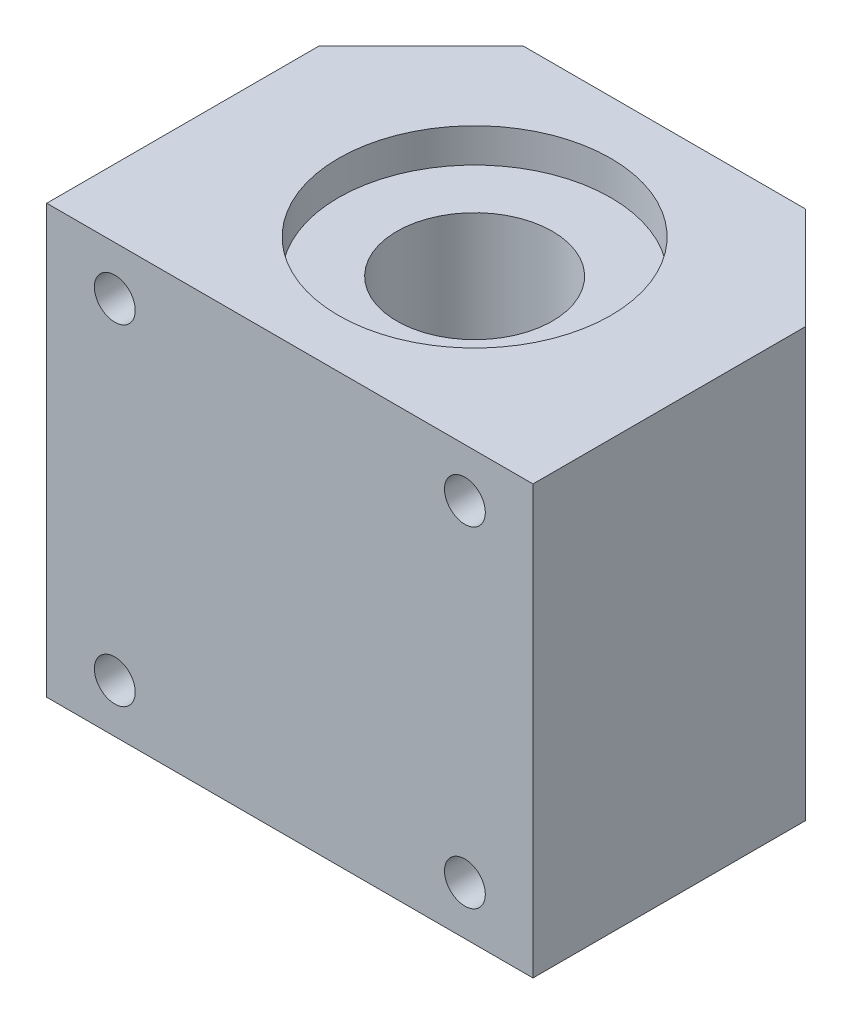
ISO-10303-21;
HEADER;
FILE_DESCRIPTION(('STEP AP214'),'2;1');
FILE_NAME('part.step','',(''),(''),'','','');
FILE_SCHEMA(('AUTOMOTIVE_DESIGN { 1 0 10303 214 1 1 1 1 }'));
ENDSEC;
DATA;
#1=APPLICATION_CONTEXT('core data for automotive mechanical design processes');
#2=APPLICATION_PROTOCOL_DEFINITION('international standard','automotive_design',2000,#1);
#3=PRODUCT_CONTEXT('',#1,'mechanical');
#4=PRODUCT('Part','Part','',(#3));
#5=PRODUCT_RELATED_PRODUCT_CATEGORY('part','',(#4));
#6=PRODUCT_DEFINITION_FORMATION('','',#4);
#7=PRODUCT_DEFINITION_CONTEXT('part definition',#1,'design');
#8=PRODUCT_DEFINITION('design','',#6,#7);
#9=PRODUCT_DEFINITION_SHAPE('','',#8);
#10=(LENGTH_UNIT() NAMED_UNIT(*) SI_UNIT(.MILLI.,.METRE.));
#11=(NAMED_UNIT(*) PLANE_ANGLE_UNIT() SI_UNIT($,.RADIAN.));
#12=(NAMED_UNIT(*) SI_UNIT($,.STERADIAN.) SOLID_ANGLE_UNIT());
#13=UNCERTAINTY_MEASURE_WITH_UNIT(LENGTH_MEASURE(1.E-05),#10,'distance_accuracy_value','');
#14=(GEOMETRIC_REPRESENTATION_CONTEXT(3) GLOBAL_UNCERTAINTY_ASSIGNED_CONTEXT((#13)) GLOBAL_UNIT_ASSIGNED_CONTEXT((#10,
#11,#12)) REPRESENTATION_CONTEXT('',''));
#15=CARTESIAN_POINT('',(0.,0.,0.));
#16=DIRECTION('',(0.,0.,1.));
#17=DIRECTION('',(1.,0.,0.));
#18=AXIS2_PLACEMENT_3D('',#15,#16,#17);
#19=CARTESIAN_POINT('',(0.,-22.,19.5));
#20=DIRECTION('',(0.,1.,0.));
#21=DIRECTION('',(0.,0.,1.));
#22=AXIS2_PLACEMENT_3D('',#19,#20,#21);
#23=CYLINDRICAL_SURFACE('',#22,14.);
#24=CARTESIAN_POINT('',(0.,22.,19.5));
#25=DIRECTION('',(0.,1.,0.));
#26=DIRECTION('',(0.,0.,1.));
#27=AXIS2_PLACEMENT_3D('',#24,#25,#26);
#28=CIRCLE('',#27,14.);
#29=CARTESIAN_POINT('',(0.,22.,33.5));
#30=VERTEX_POINT('',#29);
#31=EDGE_CURVE('E154',#30,#30,#28,.T.);
#32=ORIENTED_EDGE('',*,*,#31,.T.);
#33=EDGE_LOOP('',(#32));
#34=FACE_BOUND('',#33,.T.);
#35=CARTESIAN_POINT('',(0.,18.5,19.5));
#36=DIRECTION('',(0.,-1.,0.));
#37=DIRECTION('',(0.,0.,-1.));
#38=AXIS2_PLACEMENT_3D('',#35,#36,#37);
#39=CIRCLE('',#38,14.);
#40=CARTESIAN_POINT('',(0.,18.5,5.49999999999999));
#41=VERTEX_POINT('',#40);
#42=EDGE_CURVE('E11',#41,#41,#39,.F.);
#43=ORIENTED_EDGE('',*,*,#42,.F.);
#44=EDGE_LOOP('',(#43));
#45=FACE_BOUND('',#44,.T.);
#46=ADVANCED_FACE('F43',(#34,#45),#23,.F.);
#47=CARTESIAN_POINT('',(25.,22.,38.5));
#48=DIRECTION('',(-1.,0.,0.));
#49=DIRECTION('',(0.,-1.,0.));
#50=AXIS2_PLACEMENT_3D('',#47,#48,#49);
#51=PLANE('',#50);
#52=DIRECTION('',(0.,0.,-1.));
#53=VECTOR('',#52,1.);
#54=CARTESIAN_POINT('',(25.,-22.,38.5));
#55=LINE('',#54,#53);
#56=CARTESIAN_POINT('',(25.,-22.,38.5));
#57=VERTEX_POINT('',#56);
#58=CARTESIAN_POINT('',(25.,-22.,10.5));
#59=VERTEX_POINT('',#58);
#60=EDGE_CURVE('E122',#57,#59,#55,.T.);
#61=ORIENTED_EDGE('',*,*,#60,.T.);
#62=DIRECTION('',(0.,1.,0.));
#63=VECTOR('',#62,1.);
#64=CARTESIAN_POINT('',(25.,-22.,10.5));
#65=LINE('',#64,#63);
#66=CARTESIAN_POINT('',(25.,22.,10.5));
#67=VERTEX_POINT('',#66);
#68=EDGE_CURVE('E195',#59,#67,#65,.T.);
#69=ORIENTED_EDGE('',*,*,#68,.T.);
#70=DIRECTION('',(0.,0.,-1.));
#71=VECTOR('',#70,1.);
#72=CARTESIAN_POINT('',(25.,22.,38.5));
#73=LINE('',#72,#71);
#74=CARTESIAN_POINT('',(25.,22.,38.5));
#75=VERTEX_POINT('',#74);
#76=EDGE_CURVE('E52',#75,#67,#73,.T.);
#77=ORIENTED_EDGE('',*,*,#76,.F.);
#78=DIRECTION('',(0.,1.,0.));
#79=VECTOR('',#78,1.);
#80=CARTESIAN_POINT('',(25.,22.,38.5));
#81=LINE('',#80,#79);
#82=EDGE_CURVE('E173',#57,#75,#81,.T.);
#83=ORIENTED_EDGE('',*,*,#82,.F.);
#84=EDGE_LOOP('',(#61,#69,#77,#83));
#85=FACE_BOUND('',#84,.T.);
#86=ADVANCED_FACE('F45',(#85),#51,.F.);
#87=CARTESIAN_POINT('',(-25.,22.,38.5));
#88=DIRECTION('',(0.,-1.,0.));
#89=DIRECTION('',(0.,0.,-1.));
#90=AXIS2_PLACEMENT_3D('',#87,#88,#89);
#91=PLANE('',#90);
#92=ORIENTED_EDGE('',*,*,#31,.F.);
#93=EDGE_LOOP('',(#92));
#94=FACE_BOUND('',#93,.T.);
#95=DIRECTION('',(-1.,0.,0.));
#96=VECTOR('',#95,1.);
#97=CARTESIAN_POINT('',(-25.,22.,0.));
#98=LINE('',#97,#96);
#99=CARTESIAN_POINT('',(14.5,22.,0.));
#100=VERTEX_POINT('',#99);
#101=CARTESIAN_POINT('',(-14.5,22.,0.));
#102=VERTEX_POINT('',#101);
#103=EDGE_CURVE('E172',#100,#102,#98,.T.);
#104=ORIENTED_EDGE('',*,*,#103,.T.);
#105=DIRECTION('',(0.707106781186548,0.,-0.707106781186547));
#106=VECTOR('',#105,1.);
#107=CARTESIAN_POINT('',(-25.,22.,10.5));
#108=LINE('',#107,#106);
#109=CARTESIAN_POINT('',(-25.,22.,10.5));
#110=VERTEX_POINT('',#109);
#111=EDGE_CURVE('E59',#110,#102,#108,.T.);
#112=ORIENTED_EDGE('',*,*,#111,.F.);
#113=DIRECTION('',(0.,0.,-1.));
#114=VECTOR('',#113,1.);
#115=CARTESIAN_POINT('',(-25.,22.,38.5));
#116=LINE('',#115,#114);
#117=CARTESIAN_POINT('',(-25.,22.,38.5));
#118=VERTEX_POINT('',#117);
#119=EDGE_CURVE('E115',#118,#110,#116,.T.);
#120=ORIENTED_EDGE('',*,*,#119,.F.);
#121=DIRECTION('',(-1.,0.,0.));
#122=VECTOR('',#121,1.);
#123=CARTESIAN_POINT('',(-25.,22.,38.5));
#124=LINE('',#123,#122);
#125=EDGE_CURVE('E177',#75,#118,#124,.T.);
#126=ORIENTED_EDGE('',*,*,#125,.F.);
#127=ORIENTED_EDGE('',*,*,#76,.T.);
#128=DIRECTION('',(0.707106781186548,0.,0.707106781186547));
#129=VECTOR('',#128,1.);
#130=CARTESIAN_POINT('',(25.,22.,10.5));
#131=LINE('',#130,#129);
#132=EDGE_CURVE('E201',#100,#67,#131,.T.);
#133=ORIENTED_EDGE('',*,*,#132,.F.);
#134=EDGE_LOOP('',(#104,#112,#120,#126,#127,#133));
#135=FACE_BOUND('',#134,.T.);
#136=ADVANCED_FACE('F253',(#94,#135),#91,.F.);
#137=CARTESIAN_POINT('',(-25.,22.,38.5));
#138=DIRECTION('',(1.,0.,0.));
#139=DIRECTION('',(0.,1.,0.));
#140=AXIS2_PLACEMENT_3D('',#137,#138,#139);
#141=PLANE('',#140);
#142=ORIENTED_EDGE('',*,*,#119,.T.);
#143=DIRECTION('',(0.,1.,0.));
#144=VECTOR('',#143,1.);
#145=CARTESIAN_POINT('',(-25.,-22.,10.5));
#146=LINE('',#145,#144);
#147=CARTESIAN_POINT('',(-25.,-22.,10.5));
#148=VERTEX_POINT('',#147);
#149=EDGE_CURVE('E99',#148,#110,#146,.T.);
#150=ORIENTED_EDGE('',*,*,#149,.F.);
#151=DIRECTION('',(0.,0.,-1.));
#152=VECTOR('',#151,1.);
#153=CARTESIAN_POINT('',(-25.,-22.,38.5));
#154=LINE('',#153,#152);
#155=CARTESIAN_POINT('',(-25.,-22.,38.5));
#156=VERTEX_POINT('',#155);
#157=EDGE_CURVE('E112',#156,#148,#154,.T.);
#158=ORIENTED_EDGE('',*,*,#157,.F.);
#159=DIRECTION('',(0.,-1.,0.));
#160=VECTOR('',#159,1.);
#161=CARTESIAN_POINT('',(-25.,22.,38.5));
#162=LINE('',#161,#160);
#163=EDGE_CURVE('E181',#118,#156,#162,.T.);
#164=ORIENTED_EDGE('',*,*,#163,.F.);
#165=EDGE_LOOP('',(#142,#150,#158,#164));
#166=FACE_BOUND('',#165,.T.);
#167=ADVANCED_FACE('F110',(#166),#141,.F.);
#168=CARTESIAN_POINT('',(-25.,-22.,38.5));
#169=DIRECTION('',(0.,1.,0.));
#170=DIRECTION('',(0.,0.,1.));
#171=AXIS2_PLACEMENT_3D('',#168,#169,#170);
#172=PLANE('',#171);
#173=CARTESIAN_POINT('',(0.,-22.,19.5));
#174=DIRECTION('',(0.,1.,0.));
#175=DIRECTION('',(0.,0.,1.));
#176=AXIS2_PLACEMENT_3D('',#173,#174,#175);
#177=CIRCLE('',#176,14.);
#178=CARTESIAN_POINT('',(0.,-22.,33.5));
#179=VERTEX_POINT('',#178);
#180=EDGE_CURVE('E204',#179,#179,#177,.T.);
#181=ORIENTED_EDGE('',*,*,#180,.T.);
#182=EDGE_LOOP('',(#181));
#183=FACE_BOUND('',#182,.T.);
#184=ORIENTED_EDGE('',*,*,#157,.T.);
#185=DIRECTION('',(0.707106781186548,0.,-0.707106781186547));
#186=VECTOR('',#185,1.);
#187=CARTESIAN_POINT('',(-25.,-22.,10.5));
#188=LINE('',#187,#186);
#189=CARTESIAN_POINT('',(-14.5,-22.,0.));
#190=VERTEX_POINT('',#189);
#191=EDGE_CURVE('E95',#148,#190,#188,.T.);
#192=ORIENTED_EDGE('',*,*,#191,.T.);
#193=DIRECTION('',(1.,0.,0.));
#194=VECTOR('',#193,1.);
#195=CARTESIAN_POINT('',(-25.,-22.,0.));
#196=LINE('',#195,#194);
#197=CARTESIAN_POINT('',(14.5,-22.,0.));
#198=VERTEX_POINT('',#197);
#199=EDGE_CURVE('E178',#190,#198,#196,.T.);
#200=ORIENTED_EDGE('',*,*,#199,.T.);
#201=DIRECTION('',(0.707106781186548,0.,0.707106781186547));
#202=VECTOR('',#201,1.);
#203=CARTESIAN_POINT('',(25.,-22.,10.5));
#204=LINE('',#203,#202);
#205=EDGE_CURVE('E67',#198,#59,#204,.T.);
#206=ORIENTED_EDGE('',*,*,#205,.T.);
#207=ORIENTED_EDGE('',*,*,#60,.F.);
#208=DIRECTION('',(1.,0.,0.));
#209=VECTOR('',#208,1.);
#210=CARTESIAN_POINT('',(-25.,-22.,38.5));
#211=LINE('',#210,#209);
#212=EDGE_CURVE('E120',#156,#57,#211,.T.);
#213=ORIENTED_EDGE('',*,*,#212,.F.);
#214=EDGE_LOOP('',(#184,#192,#200,#206,#207,#213));
#215=FACE_BOUND('',#214,.T.);
#216=ADVANCED_FACE('F118',(#183,#215),#172,.F.);
#217=CARTESIAN_POINT('',(0.,0.,38.5));
#218=DIRECTION('',(0.,0.,1.));
#219=DIRECTION('',(1.,0.,0.));
#220=AXIS2_PLACEMENT_3D('',#217,#218,#219);
#221=PLANE('',#220);
#222=CARTESIAN_POINT('',(-18.,17.,38.5));
#223=DIRECTION('',(0.,0.,1.));
#224=DIRECTION('',(1.,0.,0.));
#225=AXIS2_PLACEMENT_3D('',#222,#223,#224);
#226=CIRCLE('',#225,2.09999999999999);
#227=CARTESIAN_POINT('',(-15.9,17.,38.5));
#228=VERTEX_POINT('',#227);
#229=EDGE_CURVE('E147',#228,#228,#226,.T.);
#230=ORIENTED_EDGE('',*,*,#229,.F.);
#231=EDGE_LOOP('',(#230));
#232=FACE_BOUND('',#231,.T.);
#233=CARTESIAN_POINT('',(18.,17.,38.5));
#234=DIRECTION('',(0.,0.,1.));
#235=DIRECTION('',(1.,0.,0.));
#236=AXIS2_PLACEMENT_3D('',#233,#234,#235);
#237=CIRCLE('',#236,2.09999999999999);
#238=CARTESIAN_POINT('',(20.1,17.,38.5));
#239=VERTEX_POINT('',#238);
#240=EDGE_CURVE('E160',#239,#239,#237,.T.);
#241=ORIENTED_EDGE('',*,*,#240,.F.);
#242=EDGE_LOOP('',(#241));
#243=FACE_BOUND('',#242,.T.);
#244=CARTESIAN_POINT('',(18.,-17.,38.5));
#245=DIRECTION('',(0.,0.,1.));
#246=DIRECTION('',(1.,0.,0.));
#247=AXIS2_PLACEMENT_3D('',#244,#245,#246);
#248=CIRCLE('',#247,2.09999999999999);
#249=CARTESIAN_POINT('',(20.1,-17.,38.5));
#250=VERTEX_POINT('',#249);
#251=EDGE_CURVE('E164',#250,#250,#248,.T.);
#252=ORIENTED_EDGE('',*,*,#251,.F.);
#253=EDGE_LOOP('',(#252));
#254=FACE_BOUND('',#253,.T.);
#255=CARTESIAN_POINT('',(-18.,-17.,38.5));
#256=DIRECTION('',(0.,0.,1.));
#257=DIRECTION('',(1.,0.,0.));
#258=AXIS2_PLACEMENT_3D('',#255,#256,#257);
#259=CIRCLE('',#258,2.09999999999999);
#260=CARTESIAN_POINT('',(-15.9,-17.,38.5));
#261=VERTEX_POINT('',#260);
#262=EDGE_CURVE('E168',#261,#261,#259,.T.);
#263=ORIENTED_EDGE('',*,*,#262,.F.);
#264=EDGE_LOOP('',(#263));
#265=FACE_BOUND('',#264,.T.);
#266=ORIENTED_EDGE('',*,*,#82,.T.);
#267=ORIENTED_EDGE('',*,*,#125,.T.);
#268=ORIENTED_EDGE('',*,*,#163,.T.);
#269=ORIENTED_EDGE('',*,*,#212,.T.);
#270=EDGE_LOOP('',(#266,#267,#268,#269));
#271=FACE_BOUND('',#270,.T.);
#272=ADVANCED_FACE('F284',(#232,#243,#254,#265,#271),#221,.T.);
#273=CARTESIAN_POINT('',(0.,0.,0.));
#274=DIRECTION('',(0.,0.,1.));
#275=DIRECTION('',(1.,0.,0.));
#276=AXIS2_PLACEMENT_3D('',#273,#274,#275);
#277=PLANE('',#276);
#278=ORIENTED_EDGE('',*,*,#199,.F.);
#279=DIRECTION('',(0.,1.,0.));
#280=VECTOR('',#279,1.);
#281=CARTESIAN_POINT('',(-14.5,-22.,0.));
#282=LINE('',#281,#280);
#283=EDGE_CURVE('E100',#190,#102,#282,.T.);
#284=ORIENTED_EDGE('',*,*,#283,.T.);
#285=ORIENTED_EDGE('',*,*,#103,.F.);
#286=DIRECTION('',(0.,1.,0.));
#287=VECTOR('',#286,1.);
#288=CARTESIAN_POINT('',(14.5,-22.,0.));
#289=LINE('',#288,#287);
#290=EDGE_CURVE('E192',#198,#100,#289,.T.);
#291=ORIENTED_EDGE('',*,*,#290,.F.);
#292=EDGE_LOOP('',(#278,#284,#285,#291));
#293=FACE_BOUND('',#292,.T.);
#294=ADVANCED_FACE('F190',(#293),#277,.F.);
#295=CARTESIAN_POINT('',(-18.,-17.,38.5));
#296=DIRECTION('',(0.,0.,1.));
#297=DIRECTION('',(1.,0.,0.));
#298=AXIS2_PLACEMENT_3D('',#295,#296,#297);
#299=CYLINDRICAL_SURFACE('',#298,2.09999999999999);
#300=CARTESIAN_POINT('',(-18.,-17.,3.50000000000001));
#301=DIRECTION('',(0.707106781186547,0.,0.707106781186548));
#302=DIRECTION('',(-0.707106781186548,0.,0.707106781186547));
#303=AXIS2_PLACEMENT_3D('',#300,#301,#302);
#304=ELLIPSE('',#303,2.96984848098348,2.09999999999999);
#305=CARTESIAN_POINT('',(-20.1,-17.,5.6));
#306=VERTEX_POINT('',#305);
#307=EDGE_CURVE('E137',#306,#306,#304,.F.);
#308=ORIENTED_EDGE('',*,*,#307,.T.);
#309=EDGE_LOOP('',(#308));
#310=FACE_BOUND('',#309,.T.);
#311=ORIENTED_EDGE('',*,*,#262,.T.);
#312=EDGE_LOOP('',(#311));
#313=FACE_BOUND('',#312,.T.);
#314=ADVANCED_FACE('F280',(#310,#313),#299,.F.);
#315=CARTESIAN_POINT('',(18.,-17.,38.5));
#316=DIRECTION('',(0.,0.,1.));
#317=DIRECTION('',(1.,0.,0.));
#318=AXIS2_PLACEMENT_3D('',#315,#316,#317);
#319=CYLINDRICAL_SURFACE('',#318,2.09999999999999);
#320=CARTESIAN_POINT('',(18.,-17.,3.50000000000002));
#321=DIRECTION('',(-0.707106781186547,0.,0.707106781186548));
#322=DIRECTION('',(0.707106781186548,0.,0.707106781186547));
#323=AXIS2_PLACEMENT_3D('',#320,#321,#322);
#324=ELLIPSE('',#323,2.96984848098348,2.09999999999999);
#325=CARTESIAN_POINT('',(20.1,-17.,5.60000000000001));
#326=VERTEX_POINT('',#325);
#327=EDGE_CURVE('E141',#326,#326,#324,.F.);
#328=ORIENTED_EDGE('',*,*,#327,.T.);
#329=EDGE_LOOP('',(#328));
#330=FACE_BOUND('',#329,.T.);
#331=ORIENTED_EDGE('',*,*,#251,.T.);
#332=EDGE_LOOP('',(#331));
#333=FACE_BOUND('',#332,.T.);
#334=ADVANCED_FACE('F276',(#330,#333),#319,.F.);
#335=CARTESIAN_POINT('',(18.,17.,38.5));
#336=DIRECTION('',(0.,0.,1.));
#337=DIRECTION('',(1.,0.,0.));
#338=AXIS2_PLACEMENT_3D('',#335,#336,#337);
#339=CYLINDRICAL_SURFACE('',#338,2.09999999999999);
#340=CARTESIAN_POINT('',(18.,17.,3.50000000000003));
#341=DIRECTION('',(-0.707106781186547,0.,0.707106781186548));
#342=DIRECTION('',(0.707106781186548,0.,0.707106781186547));
#343=AXIS2_PLACEMENT_3D('',#340,#341,#342);
#344=ELLIPSE('',#343,2.96984848098348,2.09999999999999);
#345=CARTESIAN_POINT('',(20.1,17.,5.60000000000002));
#346=VERTEX_POINT('',#345);
#347=EDGE_CURVE('E138',#346,#346,#344,.F.);
#348=ORIENTED_EDGE('',*,*,#347,.T.);
#349=EDGE_LOOP('',(#348));
#350=FACE_BOUND('',#349,.T.);
#351=ORIENTED_EDGE('',*,*,#240,.T.);
#352=EDGE_LOOP('',(#351));
#353=FACE_BOUND('',#352,.T.);
#354=ADVANCED_FACE('F279',(#350,#353),#339,.F.);
#355=CARTESIAN_POINT('',(-18.,17.,38.5));
#356=DIRECTION('',(0.,0.,1.));
#357=DIRECTION('',(1.,0.,0.));
#358=AXIS2_PLACEMENT_3D('',#355,#356,#357);
#359=CYLINDRICAL_SURFACE('',#358,2.09999999999999);
#360=CARTESIAN_POINT('',(-18.,17.,3.50000000000001));
#361=DIRECTION('',(0.707106781186547,0.,0.707106781186548));
#362=DIRECTION('',(-0.707106781186548,0.,0.707106781186547));
#363=AXIS2_PLACEMENT_3D('',#360,#361,#362);
#364=ELLIPSE('',#363,2.96984848098348,2.09999999999999);
#365=CARTESIAN_POINT('',(-20.1,17.,5.6));
#366=VERTEX_POINT('',#365);
#367=EDGE_CURVE('E134',#366,#366,#364,.F.);
#368=ORIENTED_EDGE('',*,*,#367,.T.);
#369=EDGE_LOOP('',(#368));
#370=FACE_BOUND('',#369,.T.);
#371=ORIENTED_EDGE('',*,*,#229,.T.);
#372=EDGE_LOOP('',(#371));
#373=FACE_BOUND('',#372,.T.);
#374=ADVANCED_FACE('F270',(#370,#373),#359,.F.);
#375=CARTESIAN_POINT('',(-25.,-22.,10.5));
#376=DIRECTION('',(0.707106781186547,0.,0.707106781186548));
#377=DIRECTION('',(0.707106781186548,0.,-0.707106781186547));
#378=AXIS2_PLACEMENT_3D('',#375,#376,#377);
#379=PLANE('',#378);
#380=ORIENTED_EDGE('',*,*,#367,.F.);
#381=EDGE_LOOP('',(#380));
#382=FACE_BOUND('',#381,.T.);
#383=ORIENTED_EDGE('',*,*,#111,.T.);
#384=ORIENTED_EDGE('',*,*,#283,.F.);
#385=ORIENTED_EDGE('',*,*,#191,.F.);
#386=ORIENTED_EDGE('',*,*,#149,.T.);
#387=EDGE_LOOP('',(#383,#384,#385,#386));
#388=FACE_BOUND('',#387,.T.);
#389=ORIENTED_EDGE('',*,*,#307,.F.);
#390=EDGE_LOOP('',(#389));
#391=FACE_BOUND('',#390,.T.);
#392=ADVANCED_FACE('F97',(#382,#388,#391),#379,.F.);
#393=CARTESIAN_POINT('',(25.,-22.,10.5));
#394=DIRECTION('',(-0.707106781186547,0.,0.707106781186548));
#395=DIRECTION('',(0.707106781186548,0.,0.707106781186547));
#396=AXIS2_PLACEMENT_3D('',#393,#394,#395);
#397=PLANE('',#396);
#398=ORIENTED_EDGE('',*,*,#347,.F.);
#399=EDGE_LOOP('',(#398));
#400=FACE_BOUND('',#399,.T.);
#401=ORIENTED_EDGE('',*,*,#132,.T.);
#402=ORIENTED_EDGE('',*,*,#68,.F.);
#403=ORIENTED_EDGE('',*,*,#205,.F.);
#404=ORIENTED_EDGE('',*,*,#290,.T.);
#405=EDGE_LOOP('',(#401,#402,#403,#404));
#406=FACE_BOUND('',#405,.T.);
#407=ORIENTED_EDGE('',*,*,#327,.F.);
#408=EDGE_LOOP('',(#407));
#409=FACE_BOUND('',#408,.T.);
#410=ADVANCED_FACE('F259',(#400,#406,#409),#397,.F.);
#411=CARTESIAN_POINT('',(0.,-18.5,19.5));
#412=DIRECTION('',(0.,-1.,0.));
#413=DIRECTION('',(0.,0.,-1.));
#414=AXIS2_PLACEMENT_3D('',#411,#412,#413);
#415=CIRCLE('',#414,14.);
#416=CARTESIAN_POINT('',(0.,-18.5,5.49999999999999));
#417=VERTEX_POINT('',#416);
#418=EDGE_CURVE('E212',#417,#417,#415,.T.);
#419=ORIENTED_EDGE('',*,*,#418,.F.);
#420=EDGE_LOOP('',(#419));
#421=FACE_BOUND('',#420,.T.);
#422=ORIENTED_EDGE('',*,*,#180,.F.);
#423=EDGE_LOOP('',(#422));
#424=FACE_BOUND('',#423,.T.);
#425=ADVANCED_FACE('F249',(#421,#424),#23,.F.);
#426=CARTESIAN_POINT('',(0.,-18.5,19.5));
#427=DIRECTION('',(0.,-1.,0.));
#428=DIRECTION('',(0.,0.,-1.));
#429=AXIS2_PLACEMENT_3D('',#426,#427,#428);
#430=PLANE('',#429);
#431=ORIENTED_EDGE('',*,*,#418,.T.);
#432=EDGE_LOOP('',(#431));
#433=FACE_BOUND('',#432,.T.);
#434=CARTESIAN_POINT('',(0.,-18.5,19.5));
#435=DIRECTION('',(0.,-1.,0.));
#436=DIRECTION('',(0.,0.,-1.));
#437=AXIS2_PLACEMENT_3D('',#434,#435,#436);
#438=CIRCLE('',#437,8.);
#439=CARTESIAN_POINT('',(0.,-18.5,11.5));
#440=VERTEX_POINT('',#439);
#441=EDGE_CURVE('E217',#440,#440,#438,.T.);
#442=ORIENTED_EDGE('',*,*,#441,.F.);
#443=EDGE_LOOP('',(#442));
#444=FACE_BOUND('',#443,.T.);
#445=ADVANCED_FACE('F243',(#433,#444),#430,.T.);
#446=CARTESIAN_POINT('',(0.,18.5,19.5));
#447=DIRECTION('',(0.,-1.,0.));
#448=DIRECTION('',(0.,0.,-1.));
#449=AXIS2_PLACEMENT_3D('',#446,#447,#448);
#450=PLANE('',#449);
#451=ORIENTED_EDGE('',*,*,#42,.T.);
#452=EDGE_LOOP('',(#451));
#453=FACE_BOUND('',#452,.T.);
#454=CARTESIAN_POINT('',(0.,18.5,19.5));
#455=DIRECTION('',(0.,-1.,0.));
#456=DIRECTION('',(0.,0.,-1.));
#457=AXIS2_PLACEMENT_3D('',#454,#455,#456);
#458=CIRCLE('',#457,8.);
#459=CARTESIAN_POINT('',(0.,18.5,11.5));
#460=VERTEX_POINT('',#459);
#461=EDGE_CURVE('E223',#460,#460,#458,.T.);
#462=ORIENTED_EDGE('',*,*,#461,.T.);
#463=EDGE_LOOP('',(#462));
#464=FACE_BOUND('',#463,.T.);
#465=ADVANCED_FACE('F234',(#453,#464),#450,.F.);
#466=CARTESIAN_POINT('',(0.,-18.5,19.5));
#467=DIRECTION('',(0.,1.,0.));
#468=DIRECTION('',(0.,0.,1.));
#469=AXIS2_PLACEMENT_3D('',#466,#467,#468);
#470=CYLINDRICAL_SURFACE('',#469,8.);
#471=ORIENTED_EDGE('',*,*,#441,.T.);
#472=EDGE_LOOP('',(#471));
#473=FACE_BOUND('',#472,.T.);
#474=ORIENTED_EDGE('',*,*,#461,.F.);
#475=EDGE_LOOP('',(#474));
#476=FACE_BOUND('',#475,.T.);
#477=ADVANCED_FACE('F236',(#473,#476),#470,.F.);
#478=CLOSED_SHELL('',(#46,#86,#136,#167,#216,#272,#294,#314,#334,#354,#374,#392,#410,#425,#445,
#465,#477));
#479=MANIFOLD_SOLID_BREP('B2',#478);
#480=ADVANCED_BREP_SHAPE_REPRESENTATION('',(#18,#479),#14);
#481=SHAPE_DEFINITION_REPRESENTATION(#9,#480);
ENDSEC;
END-ISO-10303-21;
